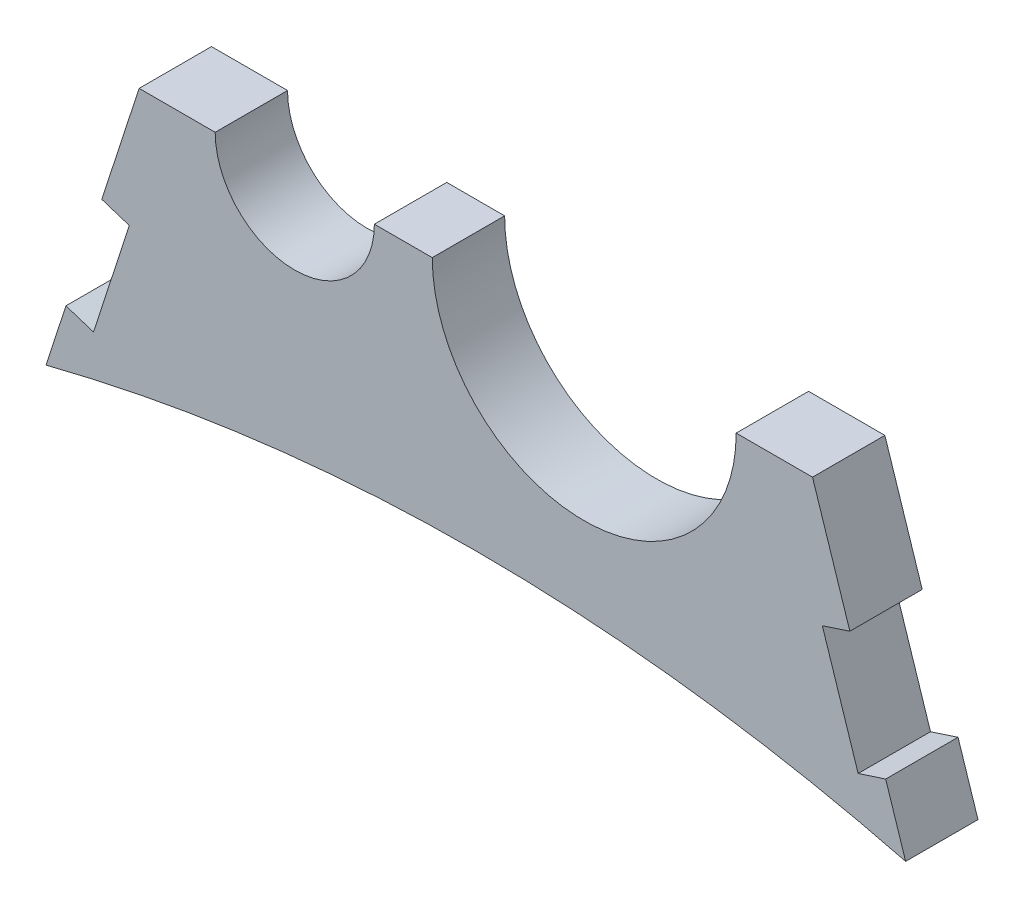
ISO-10303-21;
HEADER;
FILE_DESCRIPTION(('STEP AP214'),'2;1');
FILE_NAME('part.step','',(''),(''),'','','');
FILE_SCHEMA(('AUTOMOTIVE_DESIGN { 1 0 10303 214 1 1 1 1 }'));
ENDSEC;
DATA;
#1=APPLICATION_CONTEXT('core data for automotive mechanical design processes');
#2=APPLICATION_PROTOCOL_DEFINITION('international standard','automotive_design',2000,#1);
#3=PRODUCT_CONTEXT('',#1,'mechanical');
#4=PRODUCT('Part','Part','',(#3));
#5=PRODUCT_RELATED_PRODUCT_CATEGORY('part','',(#4));
#6=PRODUCT_DEFINITION_FORMATION('','',#4);
#7=PRODUCT_DEFINITION_CONTEXT('part definition',#1,'design');
#8=PRODUCT_DEFINITION('design','',#6,#7);
#9=PRODUCT_DEFINITION_SHAPE('','',#8);
#10=(LENGTH_UNIT() NAMED_UNIT(*) SI_UNIT(.MILLI.,.METRE.));
#11=(NAMED_UNIT(*) PLANE_ANGLE_UNIT() SI_UNIT($,.RADIAN.));
#12=(NAMED_UNIT(*) SI_UNIT($,.STERADIAN.) SOLID_ANGLE_UNIT());
#13=UNCERTAINTY_MEASURE_WITH_UNIT(LENGTH_MEASURE(1.E-05),#10,'distance_accuracy_value','');
#14=(GEOMETRIC_REPRESENTATION_CONTEXT(3) GLOBAL_UNCERTAINTY_ASSIGNED_CONTEXT((#13)) GLOBAL_UNIT_ASSIGNED_CONTEXT((#10,
#11,#12)) REPRESENTATION_CONTEXT('',''));
#15=CARTESIAN_POINT('',(0.,0.,0.));
#16=DIRECTION('',(0.,0.,1.));
#17=DIRECTION('',(1.,0.,0.));
#18=AXIS2_PLACEMENT_3D('',#15,#16,#17);
#19=CARTESIAN_POINT('',(9.5123,172.775844824906,6.35));
#20=DIRECTION('',(0.,0.,-1.));
#21=DIRECTION('',(-1.,0.,0.));
#22=AXIS2_PLACEMENT_3D('',#19,#20,#21);
#23=CYLINDRICAL_SURFACE('',#22,13.335);
#24=CARTESIAN_POINT('',(9.5123,172.775844824906,0.));
#25=DIRECTION('',(0.,0.,-1.));
#26=DIRECTION('',(1.,0.,0.));
#27=AXIS2_PLACEMENT_3D('',#24,#25,#26);
#28=CIRCLE('',#27,13.335);
#29=CARTESIAN_POINT('',(22.8473,172.775844824906,0.));
#30=VERTEX_POINT('',#29);
#31=CARTESIAN_POINT('',(-3.82270000000001,172.775844824906,0.));
#32=VERTEX_POINT('',#31);
#33=EDGE_CURVE('E180',#30,#32,#28,.T.);
#34=ORIENTED_EDGE('',*,*,#33,.T.);
#35=DIRECTION('',(0.,0.,-1.));
#36=VECTOR('',#35,1.);
#37=CARTESIAN_POINT('',(-3.82270000000001,172.775844824906,6.35));
#38=LINE('',#37,#36);
#39=CARTESIAN_POINT('',(-3.82270000000001,172.775844824906,6.35));
#40=VERTEX_POINT('',#39);
#41=EDGE_CURVE('E11',#40,#32,#38,.T.);
#42=ORIENTED_EDGE('',*,*,#41,.F.);
#43=CARTESIAN_POINT('',(9.5123,172.775844824906,6.35));
#44=DIRECTION('',(0.,0.,-1.));
#45=DIRECTION('',(1.,0.,0.));
#46=AXIS2_PLACEMENT_3D('',#43,#44,#45);
#47=CIRCLE('',#46,13.335);
#48=CARTESIAN_POINT('',(22.8473,172.775844824906,6.35));
#49=VERTEX_POINT('',#48);
#50=EDGE_CURVE('E210',#49,#40,#47,.T.);
#51=ORIENTED_EDGE('',*,*,#50,.F.);
#52=DIRECTION('',(0.,0.,-1.));
#53=VECTOR('',#52,1.);
#54=CARTESIAN_POINT('',(22.8473,172.775844824906,6.35));
#55=LINE('',#54,#53);
#56=EDGE_CURVE('E176',#49,#30,#55,.T.);
#57=ORIENTED_EDGE('',*,*,#56,.T.);
#58=EDGE_LOOP('',(#34,#42,#51,#57));
#59=FACE_BOUND('',#58,.T.);
#60=ADVANCED_FACE('F36',(#59),#23,.F.);
#61=CARTESIAN_POINT('',(-8.90269999999999,172.775844824906,6.35));
#62=DIRECTION('',(0.,-1.,0.));
#63=DIRECTION('',(0.,0.,-1.));
#64=AXIS2_PLACEMENT_3D('',#61,#62,#63);
#65=PLANE('',#64);
#66=DIRECTION('',(-1.,0.,0.));
#67=VECTOR('',#66,1.);
#68=CARTESIAN_POINT('',(-8.90269999999999,172.775844824906,0.));
#69=LINE('',#68,#67);
#70=CARTESIAN_POINT('',(-8.90269999999999,172.775844824906,0.));
#71=VERTEX_POINT('',#70);
#72=EDGE_CURVE('E183',#32,#71,#69,.T.);
#73=ORIENTED_EDGE('',*,*,#72,.T.);
#74=DIRECTION('',(0.,0.,-1.));
#75=VECTOR('',#74,1.);
#76=CARTESIAN_POINT('',(-8.90269999999999,172.775844824906,6.35));
#77=LINE('',#76,#75);
#78=CARTESIAN_POINT('',(-8.90269999999999,172.775844824906,6.35));
#79=VERTEX_POINT('',#78);
#80=EDGE_CURVE('E44',#79,#71,#77,.T.);
#81=ORIENTED_EDGE('',*,*,#80,.F.);
#82=DIRECTION('',(-1.,0.,0.));
#83=VECTOR('',#82,1.);
#84=CARTESIAN_POINT('',(-8.90269999999999,172.775844824906,6.35));
#85=LINE('',#84,#83);
#86=EDGE_CURVE('E119',#40,#79,#85,.T.);
#87=ORIENTED_EDGE('',*,*,#86,.F.);
#88=ORIENTED_EDGE('',*,*,#41,.T.);
#89=EDGE_LOOP('',(#73,#81,#87,#88));
#90=FACE_BOUND('',#89,.T.);
#91=ADVANCED_FACE('F308',(#90),#65,.F.);
#92=CARTESIAN_POINT('',(-15.8877,172.775844824906,6.35));
#93=DIRECTION('',(0.,0.,-1.));
#94=DIRECTION('',(-1.,0.,0.));
#95=AXIS2_PLACEMENT_3D('',#92,#93,#94);
#96=CYLINDRICAL_SURFACE('',#95,6.985);
#97=CARTESIAN_POINT('',(-15.8877,172.775844824906,0.));
#98=DIRECTION('',(0.,0.,-1.));
#99=DIRECTION('',(1.,0.,0.));
#100=AXIS2_PLACEMENT_3D('',#97,#98,#99);
#101=CIRCLE('',#100,6.985);
#102=CARTESIAN_POINT('',(-22.8727,172.775844824906,0.));
#103=VERTEX_POINT('',#102);
#104=EDGE_CURVE('E185',#71,#103,#101,.T.);
#105=ORIENTED_EDGE('',*,*,#104,.T.);
#106=DIRECTION('',(0.,0.,-1.));
#107=VECTOR('',#106,1.);
#108=CARTESIAN_POINT('',(-22.8727,172.775844824906,6.35));
#109=LINE('',#108,#107);
#110=CARTESIAN_POINT('',(-22.8727,172.775844824906,6.35));
#111=VERTEX_POINT('',#110);
#112=EDGE_CURVE('E241',#111,#103,#109,.T.);
#113=ORIENTED_EDGE('',*,*,#112,.F.);
#114=CARTESIAN_POINT('',(-15.8877,172.775844824906,6.35));
#115=DIRECTION('',(0.,0.,-1.));
#116=DIRECTION('',(1.,0.,0.));
#117=AXIS2_PLACEMENT_3D('',#114,#115,#116);
#118=CIRCLE('',#117,6.985);
#119=EDGE_CURVE('E249',#79,#111,#118,.T.);
#120=ORIENTED_EDGE('',*,*,#119,.F.);
#121=ORIENTED_EDGE('',*,*,#80,.T.);
#122=EDGE_LOOP('',(#105,#113,#120,#121));
#123=FACE_BOUND('',#122,.T.);
#124=ADVANCED_FACE('F247',(#123),#96,.F.);
#125=CARTESIAN_POINT('',(-29.5452417978428,172.775844824906,6.35));
#126=DIRECTION('',(0.,-1.,0.));
#127=DIRECTION('',(0.,0.,-1.));
#128=AXIS2_PLACEMENT_3D('',#125,#126,#127);
#129=PLANE('',#128);
#130=DIRECTION('',(-1.,0.,0.));
#131=VECTOR('',#130,1.);
#132=CARTESIAN_POINT('',(-29.5452417978428,172.775844824906,0.));
#133=LINE('',#132,#131);
#134=CARTESIAN_POINT('',(-29.5452417978428,172.775844824906,0.));
#135=VERTEX_POINT('',#134);
#136=EDGE_CURVE('E187',#103,#135,#133,.T.);
#137=ORIENTED_EDGE('',*,*,#136,.T.);
#138=DIRECTION('',(0.,0.,-1.));
#139=VECTOR('',#138,1.);
#140=CARTESIAN_POINT('',(-29.5452417978428,172.775844824906,6.35));
#141=LINE('',#140,#139);
#142=CARTESIAN_POINT('',(-29.5452417978428,172.775844824906,6.35));
#143=VERTEX_POINT('',#142);
#144=EDGE_CURVE('E238',#143,#135,#141,.T.);
#145=ORIENTED_EDGE('',*,*,#144,.F.);
#146=DIRECTION('',(-1.,0.,0.));
#147=VECTOR('',#146,1.);
#148=CARTESIAN_POINT('',(-29.5452417978428,172.775844824906,6.35));
#149=LINE('',#148,#147);
#150=EDGE_CURVE('E267',#111,#143,#149,.T.);
#151=ORIENTED_EDGE('',*,*,#150,.F.);
#152=ORIENTED_EDGE('',*,*,#112,.T.);
#153=EDGE_LOOP('',(#137,#145,#151,#152));
#154=FACE_BOUND('',#153,.T.);
#155=ADVANCED_FACE('F258',(#154),#129,.F.);
#156=CARTESIAN_POINT('',(-29.5452417978428,172.775844824906,6.35));
#157=DIRECTION('',(0.950933726670704,-0.309394646818859,0.));
#158=DIRECTION('',(0.309394646818859,0.950933726670704,0.));
#159=AXIS2_PLACEMENT_3D('',#156,#157,#158);
#160=PLANE('',#159);
#161=DIRECTION('',(-0.309394646818859,-0.950933726670704,0.));
#162=VECTOR('',#161,1.);
#163=CARTESIAN_POINT('',(-29.5452417978428,172.775844824906,0.));
#164=LINE('',#163,#162);
#165=CARTESIAN_POINT('',(-32.8220378117665,162.704513995176,0.));
#166=VERTEX_POINT('',#165);
#167=EDGE_CURVE('E189',#135,#166,#164,.T.);
#168=ORIENTED_EDGE('',*,*,#167,.T.);
#169=DIRECTION('',(0.,0.,-1.));
#170=VECTOR('',#169,1.);
#171=CARTESIAN_POINT('',(-32.8220378117665,162.704513995176,6.35));
#172=LINE('',#171,#170);
#173=CARTESIAN_POINT('',(-32.8220378117665,162.704513995176,6.35));
#174=VERTEX_POINT('',#173);
#175=EDGE_CURVE('E235',#174,#166,#172,.T.);
#176=ORIENTED_EDGE('',*,*,#175,.F.);
#177=DIRECTION('',(-0.309394646818859,-0.950933726670704,0.));
#178=VECTOR('',#177,1.);
#179=CARTESIAN_POINT('',(-29.5452417978428,172.775844824906,6.35));
#180=LINE('',#179,#178);
#181=EDGE_CURVE('E264',#143,#174,#180,.T.);
#182=ORIENTED_EDGE('',*,*,#181,.F.);
#183=ORIENTED_EDGE('',*,*,#144,.T.);
#184=EDGE_LOOP('',(#168,#176,#182,#183));
#185=FACE_BOUND('',#184,.T.);
#186=ADVANCED_FACE('F262',(#185),#160,.F.);
#187=CARTESIAN_POINT('',(-32.8220378117665,162.704513995176,6.35));
#188=DIRECTION('',(0.309394646818844,0.950933726670709,0.));
#189=DIRECTION('',(-0.950933726670709,0.309394646818844,0.));
#190=AXIS2_PLACEMENT_3D('',#187,#188,#189);
#191=PLANE('',#190);
#192=DIRECTION('',(0.950933726670709,-0.309394646818844,0.));
#193=VECTOR('',#192,1.);
#194=CARTESIAN_POINT('',(-32.8220378117665,162.704513995176,0.));
#195=LINE('',#194,#193);
#196=CARTESIAN_POINT('',(-30.4066661460229,161.918651592256,0.));
#197=VERTEX_POINT('',#196);
#198=EDGE_CURVE('E191',#166,#197,#195,.T.);
#199=ORIENTED_EDGE('',*,*,#198,.T.);
#200=DIRECTION('',(0.,0.,-1.));
#201=VECTOR('',#200,1.);
#202=CARTESIAN_POINT('',(-30.4066661460229,161.918651592256,6.35));
#203=LINE('',#202,#201);
#204=CARTESIAN_POINT('',(-30.4066661460229,161.918651592256,6.35));
#205=VERTEX_POINT('',#204);
#206=EDGE_CURVE('E232',#205,#197,#203,.T.);
#207=ORIENTED_EDGE('',*,*,#206,.F.);
#208=DIRECTION('',(0.950933726670709,-0.309394646818844,0.));
#209=VECTOR('',#208,1.);
#210=CARTESIAN_POINT('',(-32.8220378117665,162.704513995176,6.35));
#211=LINE('',#210,#209);
#212=EDGE_CURVE('E266',#174,#205,#211,.T.);
#213=ORIENTED_EDGE('',*,*,#212,.F.);
#214=ORIENTED_EDGE('',*,*,#175,.T.);
#215=EDGE_LOOP('',(#199,#207,#213,#214));
#216=FACE_BOUND('',#215,.T.);
#217=ADVANCED_FACE('F321',(#216),#191,.F.);
#218=CARTESIAN_POINT('',(-30.4066661460229,161.918651592256,6.35));
#219=DIRECTION('',(0.950933726670734,-0.309394646818767,0.));
#220=DIRECTION('',(0.309394646818767,0.950933726670734,0.));
#221=AXIS2_PLACEMENT_3D('',#218,#219,#220);
#222=PLANE('',#221);
#223=DIRECTION('',(-0.309394646818767,-0.950933726670734,0.));
#224=VECTOR('',#223,1.);
#225=CARTESIAN_POINT('',(-30.4066661460229,161.918651592256,0.));
#226=LINE('',#225,#224);
#227=CARTESIAN_POINT('',(-33.5501157577015,152.257164929282,0.));
#228=VERTEX_POINT('',#227);
#229=EDGE_CURVE('E193',#197,#228,#226,.T.);
#230=ORIENTED_EDGE('',*,*,#229,.T.);
#231=DIRECTION('',(0.,0.,-1.));
#232=VECTOR('',#231,1.);
#233=CARTESIAN_POINT('',(-33.5501157577015,152.257164929282,6.35));
#234=LINE('',#233,#232);
#235=CARTESIAN_POINT('',(-33.5501157577015,152.257164929282,6.35));
#236=VERTEX_POINT('',#235);
#237=EDGE_CURVE('E229',#236,#228,#234,.T.);
#238=ORIENTED_EDGE('',*,*,#237,.F.);
#239=DIRECTION('',(-0.309394646818767,-0.950933726670734,0.));
#240=VECTOR('',#239,1.);
#241=CARTESIAN_POINT('',(-30.4066661460229,161.918651592256,6.35));
#242=LINE('',#241,#240);
#243=EDGE_CURVE('E269',#205,#236,#242,.T.);
#244=ORIENTED_EDGE('',*,*,#243,.F.);
#245=ORIENTED_EDGE('',*,*,#206,.T.);
#246=EDGE_LOOP('',(#230,#238,#244,#245));
#247=FACE_BOUND('',#246,.T.);
#248=ADVANCED_FACE('F324',(#247),#222,.F.);
#249=CARTESIAN_POINT('',(-33.5501157577015,152.257164929282,6.35));
#250=DIRECTION('',(-0.309394646818855,-0.950933726670706,0.));
#251=DIRECTION('',(0.950933726670706,-0.309394646818855,0.));
#252=AXIS2_PLACEMENT_3D('',#249,#250,#251);
#253=PLANE('',#252);
#254=DIRECTION('',(-0.950933726670706,0.309394646818855,0.));
#255=VECTOR('',#254,1.);
#256=CARTESIAN_POINT('',(-33.5501157577015,152.257164929282,0.));
#257=LINE('',#256,#255);
#258=CARTESIAN_POINT('',(-35.9654874234461,153.043027332202,0.));
#259=VERTEX_POINT('',#258);
#260=EDGE_CURVE('E195',#228,#259,#257,.T.);
#261=ORIENTED_EDGE('',*,*,#260,.T.);
#262=DIRECTION('',(0.,0.,-1.));
#263=VECTOR('',#262,1.);
#264=CARTESIAN_POINT('',(-35.9654874234461,153.043027332202,6.35));
#265=LINE('',#264,#263);
#266=CARTESIAN_POINT('',(-35.9654874234461,153.043027332202,6.35));
#267=VERTEX_POINT('',#266);
#268=EDGE_CURVE('E226',#267,#259,#265,.T.);
#269=ORIENTED_EDGE('',*,*,#268,.F.);
#270=DIRECTION('',(-0.950933726670706,0.309394646818855,0.));
#271=VECTOR('',#270,1.);
#272=CARTESIAN_POINT('',(-33.5501157577015,152.257164929282,6.35));
#273=LINE('',#272,#271);
#274=EDGE_CURVE('E275',#236,#267,#273,.T.);
#275=ORIENTED_EDGE('',*,*,#274,.F.);
#276=ORIENTED_EDGE('',*,*,#237,.T.);
#277=EDGE_LOOP('',(#261,#269,#275,#276));
#278=FACE_BOUND('',#277,.T.);
#279=ADVANCED_FACE('F328',(#278),#253,.F.);
#280=CARTESIAN_POINT('',(-37.7172395441766,147.658964648839,6.35));
#281=DIRECTION('',(0.950933726670701,-0.309394646818868,0.));
#282=DIRECTION('',(0.309394646818868,0.950933726670701,0.));
#283=AXIS2_PLACEMENT_3D('',#280,#281,#282);
#284=PLANE('',#283);
#285=DIRECTION('',(-0.309394646818868,-0.950933726670701,0.));
#286=VECTOR('',#285,1.);
#287=CARTESIAN_POINT('',(-37.7172395441766,147.658964648839,0.));
#288=LINE('',#287,#286);
#289=CARTESIAN_POINT('',(-37.7172395441766,147.658964648839,0.));
#290=VERTEX_POINT('',#289);
#291=EDGE_CURVE('E197',#259,#290,#288,.T.);
#292=ORIENTED_EDGE('',*,*,#291,.T.);
#293=DIRECTION('',(0.,0.,-1.));
#294=VECTOR('',#293,1.);
#295=CARTESIAN_POINT('',(-37.7172395441766,147.658964648839,6.35));
#296=LINE('',#295,#294);
#297=CARTESIAN_POINT('',(-37.7172395441766,147.658964648839,6.35));
#298=VERTEX_POINT('',#297);
#299=EDGE_CURVE('E223',#298,#290,#296,.T.);
#300=ORIENTED_EDGE('',*,*,#299,.F.);
#301=DIRECTION('',(-0.309394646818868,-0.950933726670701,0.));
#302=VECTOR('',#301,1.);
#303=CARTESIAN_POINT('',(-37.7172395441766,147.658964648839,6.35));
#304=LINE('',#303,#302);
#305=EDGE_CURVE('E277',#267,#298,#304,.T.);
#306=ORIENTED_EDGE('',*,*,#305,.F.);
#307=ORIENTED_EDGE('',*,*,#268,.T.);
#308=EDGE_LOOP('',(#292,#300,#306,#307));
#309=FACE_BOUND('',#308,.T.);
#310=ADVANCED_FACE('F332',(#309),#284,.F.);
#311=CARTESIAN_POINT('',(0.,0.,6.35));
#312=DIRECTION('',(0.,0.,-1.));
#313=DIRECTION('',(-1.,0.,0.));
#314=AXIS2_PLACEMENT_3D('',#311,#312,#313);
#315=CYLINDRICAL_SURFACE('',#314,152.4);
#316=CARTESIAN_POINT('',(0.,0.,0.));
#317=DIRECTION('',(0.,0.,-1.));
#318=DIRECTION('',(1.,0.,0.));
#319=AXIS2_PLACEMENT_3D('',#316,#317,#318);
#320=CIRCLE('',#319,152.4);
#321=CARTESIAN_POINT('',(37.7172395441766,147.658964648839,0.));
#322=VERTEX_POINT('',#321);
#323=EDGE_CURVE('E199',#290,#322,#320,.T.);
#324=ORIENTED_EDGE('',*,*,#323,.T.);
#325=DIRECTION('',(0.,0.,-1.));
#326=VECTOR('',#325,1.);
#327=CARTESIAN_POINT('',(37.7172395441766,147.658964648839,6.35));
#328=LINE('',#327,#326);
#329=CARTESIAN_POINT('',(37.7172395441766,147.658964648839,6.35));
#330=VERTEX_POINT('',#329);
#331=EDGE_CURVE('E220',#330,#322,#328,.T.);
#332=ORIENTED_EDGE('',*,*,#331,.F.);
#333=CARTESIAN_POINT('',(0.,0.,6.35));
#334=DIRECTION('',(0.,0.,-1.));
#335=DIRECTION('',(1.,0.,0.));
#336=AXIS2_PLACEMENT_3D('',#333,#334,#335);
#337=CIRCLE('',#336,152.4);
#338=EDGE_CURVE('E279',#298,#330,#337,.T.);
#339=ORIENTED_EDGE('',*,*,#338,.F.);
#340=ORIENTED_EDGE('',*,*,#299,.T.);
#341=EDGE_LOOP('',(#324,#332,#339,#340));
#342=FACE_BOUND('',#341,.T.);
#343=ADVANCED_FACE('F336',(#342),#315,.F.);
#344=CARTESIAN_POINT('',(37.7172395441766,147.658964648839,6.35));
#345=DIRECTION('',(-0.950933726670705,-0.309394646818857,0.));
#346=DIRECTION('',(0.309394646818857,-0.950933726670705,0.));
#347=AXIS2_PLACEMENT_3D('',#344,#345,#346);
#348=PLANE('',#347);
#349=DIRECTION('',(-0.309394646818857,0.950933726670705,0.));
#350=VECTOR('',#349,1.);
#351=CARTESIAN_POINT('',(37.7172395441766,147.658964648839,0.));
#352=LINE('',#351,#350);
#353=CARTESIAN_POINT('',(35.9654874234463,153.043027332201,0.));
#354=VERTEX_POINT('',#353);
#355=EDGE_CURVE('E201',#322,#354,#352,.T.);
#356=ORIENTED_EDGE('',*,*,#355,.T.);
#357=DIRECTION('',(0.,0.,-1.));
#358=VECTOR('',#357,1.);
#359=CARTESIAN_POINT('',(35.9654874234463,153.043027332201,6.35));
#360=LINE('',#359,#358);
#361=CARTESIAN_POINT('',(35.9654874234463,153.043027332201,6.35));
#362=VERTEX_POINT('',#361);
#363=EDGE_CURVE('E217',#362,#354,#360,.T.);
#364=ORIENTED_EDGE('',*,*,#363,.F.);
#365=DIRECTION('',(-0.309394646818857,0.950933726670705,0.));
#366=VECTOR('',#365,1.);
#367=CARTESIAN_POINT('',(37.7172395441766,147.658964648839,6.35));
#368=LINE('',#367,#366);
#369=EDGE_CURVE('E281',#330,#362,#368,.T.);
#370=ORIENTED_EDGE('',*,*,#369,.F.);
#371=ORIENTED_EDGE('',*,*,#331,.T.);
#372=EDGE_LOOP('',(#356,#364,#370,#371));
#373=FACE_BOUND('',#372,.T.);
#374=ADVANCED_FACE('F340',(#373),#348,.F.);
#375=CARTESIAN_POINT('',(33.5501157577026,152.257164929281,6.35));
#376=DIRECTION('',(0.309394646818867,-0.950933726670701,0.));
#377=DIRECTION('',(0.950933726670702,0.309394646818867,0.));
#378=AXIS2_PLACEMENT_3D('',#375,#376,#377);
#379=PLANE('',#378);
#380=DIRECTION('',(-0.950933726670701,-0.309394646818867,0.));
#381=VECTOR('',#380,1.);
#382=CARTESIAN_POINT('',(33.5501157577026,152.257164929281,0.));
#383=LINE('',#382,#381);
#384=CARTESIAN_POINT('',(33.5501157577026,152.257164929281,0.));
#385=VERTEX_POINT('',#384);
#386=EDGE_CURVE('E203',#354,#385,#383,.T.);
#387=ORIENTED_EDGE('',*,*,#386,.T.);
#388=DIRECTION('',(0.,0.,-1.));
#389=VECTOR('',#388,1.);
#390=CARTESIAN_POINT('',(33.5501157577026,152.257164929281,6.35));
#391=LINE('',#390,#389);
#392=CARTESIAN_POINT('',(33.5501157577026,152.257164929281,6.35));
#393=VERTEX_POINT('',#392);
#394=EDGE_CURVE('E214',#393,#385,#391,.T.);
#395=ORIENTED_EDGE('',*,*,#394,.F.);
#396=DIRECTION('',(-0.950933726670701,-0.309394646818867,0.));
#397=VECTOR('',#396,1.);
#398=CARTESIAN_POINT('',(33.5501157577026,152.257164929281,6.35));
#399=LINE('',#398,#397);
#400=EDGE_CURVE('E283',#362,#393,#399,.T.);
#401=ORIENTED_EDGE('',*,*,#400,.F.);
#402=ORIENTED_EDGE('',*,*,#363,.T.);
#403=EDGE_LOOP('',(#387,#395,#401,#402));
#404=FACE_BOUND('',#403,.T.);
#405=ADVANCED_FACE('F289',(#404),#379,.F.);
#406=CARTESIAN_POINT('',(30.406666146023,161.918651592256,6.35));
#407=DIRECTION('',(-0.950933726670704,-0.309394646818858,0.));
#408=DIRECTION('',(0.309394646818858,-0.950933726670704,0.));
#409=AXIS2_PLACEMENT_3D('',#406,#407,#408);
#410=PLANE('',#409);
#411=DIRECTION('',(-0.309394646818858,0.950933726670704,0.));
#412=VECTOR('',#411,1.);
#413=CARTESIAN_POINT('',(30.406666146023,161.918651592256,0.));
#414=LINE('',#413,#412);
#415=CARTESIAN_POINT('',(30.406666146023,161.918651592256,0.));
#416=VERTEX_POINT('',#415);
#417=EDGE_CURVE('E205',#385,#416,#414,.T.);
#418=ORIENTED_EDGE('',*,*,#417,.T.);
#419=DIRECTION('',(0.,0.,-1.));
#420=VECTOR('',#419,1.);
#421=CARTESIAN_POINT('',(30.406666146023,161.918651592256,6.35));
#422=LINE('',#421,#420);
#423=CARTESIAN_POINT('',(30.406666146023,161.918651592256,6.35));
#424=VERTEX_POINT('',#423);
#425=EDGE_CURVE('E171',#424,#416,#422,.T.);
#426=ORIENTED_EDGE('',*,*,#425,.F.);
#427=DIRECTION('',(-0.309394646818858,0.950933726670704,0.));
#428=VECTOR('',#427,1.);
#429=CARTESIAN_POINT('',(30.406666146023,161.918651592256,6.35));
#430=LINE('',#429,#428);
#431=EDGE_CURVE('E162',#393,#424,#430,.T.);
#432=ORIENTED_EDGE('',*,*,#431,.F.);
#433=ORIENTED_EDGE('',*,*,#394,.T.);
#434=EDGE_LOOP('',(#418,#426,#432,#433));
#435=FACE_BOUND('',#434,.T.);
#436=ADVANCED_FACE('F293',(#435),#410,.F.);
#437=CARTESIAN_POINT('',(32.8220378117667,162.704513995176,6.35));
#438=DIRECTION('',(-0.30939464681887,0.950933726670701,0.));
#439=DIRECTION('',(-0.950933726670701,-0.30939464681887,0.));
#440=AXIS2_PLACEMENT_3D('',#437,#438,#439);
#441=PLANE('',#440);
#442=DIRECTION('',(0.950933726670701,0.30939464681887,0.));
#443=VECTOR('',#442,1.);
#444=CARTESIAN_POINT('',(32.8220378117667,162.704513995176,0.));
#445=LINE('',#444,#443);
#446=CARTESIAN_POINT('',(32.8220378117667,162.704513995176,0.));
#447=VERTEX_POINT('',#446);
#448=EDGE_CURVE('E170',#416,#447,#445,.T.);
#449=ORIENTED_EDGE('',*,*,#448,.T.);
#450=DIRECTION('',(0.,0.,-1.));
#451=VECTOR('',#450,1.);
#452=CARTESIAN_POINT('',(32.8220378117667,162.704513995176,6.35));
#453=LINE('',#452,#451);
#454=CARTESIAN_POINT('',(32.8220378117667,162.704513995176,6.35));
#455=VERTEX_POINT('',#454);
#456=EDGE_CURVE('E167',#455,#447,#453,.T.);
#457=ORIENTED_EDGE('',*,*,#456,.F.);
#458=DIRECTION('',(0.950933726670701,0.30939464681887,0.));
#459=VECTOR('',#458,1.);
#460=CARTESIAN_POINT('',(32.8220378117667,162.704513995176,6.35));
#461=LINE('',#460,#459);
#462=EDGE_CURVE('E156',#424,#455,#461,.T.);
#463=ORIENTED_EDGE('',*,*,#462,.F.);
#464=ORIENTED_EDGE('',*,*,#425,.T.);
#465=EDGE_LOOP('',(#449,#457,#463,#464));
#466=FACE_BOUND('',#465,.T.);
#467=ADVANCED_FACE('F168',(#466),#441,.F.);
#468=CARTESIAN_POINT('',(29.5452417978428,172.775844824906,6.35));
#469=DIRECTION('',(-0.950933726670703,-0.309394646818863,0.));
#470=DIRECTION('',(0.309394646818863,-0.950933726670703,0.));
#471=AXIS2_PLACEMENT_3D('',#468,#469,#470);
#472=PLANE('',#471);
#473=DIRECTION('',(-0.309394646818863,0.950933726670703,0.));
#474=VECTOR('',#473,1.);
#475=CARTESIAN_POINT('',(29.5452417978428,172.775844824906,0.));
#476=LINE('',#475,#474);
#477=CARTESIAN_POINT('',(29.5452417978428,172.775844824906,0.));
#478=VERTEX_POINT('',#477);
#479=EDGE_CURVE('E105',#447,#478,#476,.T.);
#480=ORIENTED_EDGE('',*,*,#479,.T.);
#481=DIRECTION('',(0.,0.,-1.));
#482=VECTOR('',#481,1.);
#483=CARTESIAN_POINT('',(29.5452417978428,172.775844824906,6.35));
#484=LINE('',#483,#482);
#485=CARTESIAN_POINT('',(29.5452417978428,172.775844824906,6.35));
#486=VERTEX_POINT('',#485);
#487=EDGE_CURVE('E172',#486,#478,#484,.T.);
#488=ORIENTED_EDGE('',*,*,#487,.F.);
#489=DIRECTION('',(-0.309394646818863,0.950933726670703,0.));
#490=VECTOR('',#489,1.);
#491=CARTESIAN_POINT('',(29.5452417978428,172.775844824906,6.35));
#492=LINE('',#491,#490);
#493=EDGE_CURVE('E160',#455,#486,#492,.T.);
#494=ORIENTED_EDGE('',*,*,#493,.F.);
#495=ORIENTED_EDGE('',*,*,#456,.T.);
#496=EDGE_LOOP('',(#480,#488,#494,#495));
#497=FACE_BOUND('',#496,.T.);
#498=ADVANCED_FACE('F174',(#497),#472,.F.);
#499=CARTESIAN_POINT('',(22.8473,172.775844824906,6.35));
#500=DIRECTION('',(0.,-1.,0.));
#501=DIRECTION('',(0.,0.,-1.));
#502=AXIS2_PLACEMENT_3D('',#499,#500,#501);
#503=PLANE('',#502);
#504=DIRECTION('',(-1.,0.,0.));
#505=VECTOR('',#504,1.);
#506=CARTESIAN_POINT('',(22.8473,172.775844824906,0.));
#507=LINE('',#506,#505);
#508=EDGE_CURVE('E111',#478,#30,#507,.T.);
#509=ORIENTED_EDGE('',*,*,#508,.T.);
#510=ORIENTED_EDGE('',*,*,#56,.F.);
#511=DIRECTION('',(-1.,0.,0.));
#512=VECTOR('',#511,1.);
#513=CARTESIAN_POINT('',(22.8473,172.775844824906,6.35));
#514=LINE('',#513,#512);
#515=EDGE_CURVE('E52',#486,#49,#514,.T.);
#516=ORIENTED_EDGE('',*,*,#515,.F.);
#517=ORIENTED_EDGE('',*,*,#487,.T.);
#518=EDGE_LOOP('',(#509,#510,#516,#517));
#519=FACE_BOUND('',#518,.T.);
#520=ADVANCED_FACE('F297',(#519),#503,.F.);
#521=CARTESIAN_POINT('',(9.5123,172.775844824906,6.35));
#522=DIRECTION('',(0.,0.,1.));
#523=DIRECTION('',(1.,0.,0.));
#524=AXIS2_PLACEMENT_3D('',#521,#522,#523);
#525=PLANE('',#524);
#526=ORIENTED_EDGE('',*,*,#50,.T.);
#527=ORIENTED_EDGE('',*,*,#86,.T.);
#528=ORIENTED_EDGE('',*,*,#119,.T.);
#529=ORIENTED_EDGE('',*,*,#150,.T.);
#530=ORIENTED_EDGE('',*,*,#181,.T.);
#531=ORIENTED_EDGE('',*,*,#212,.T.);
#532=ORIENTED_EDGE('',*,*,#243,.T.);
#533=ORIENTED_EDGE('',*,*,#274,.T.);
#534=ORIENTED_EDGE('',*,*,#305,.T.);
#535=ORIENTED_EDGE('',*,*,#338,.T.);
#536=ORIENTED_EDGE('',*,*,#369,.T.);
#537=ORIENTED_EDGE('',*,*,#400,.T.);
#538=ORIENTED_EDGE('',*,*,#431,.T.);
#539=ORIENTED_EDGE('',*,*,#462,.T.);
#540=ORIENTED_EDGE('',*,*,#493,.T.);
#541=ORIENTED_EDGE('',*,*,#515,.T.);
#542=EDGE_LOOP('',(#526,#527,#528,#529,#530,#531,#532,#533,#534,#535,#536,#537,#538,#539,#540,#541));
#543=FACE_BOUND('',#542,.T.);
#544=ADVANCED_FACE('F158',(#543),#525,.T.);
#545=CARTESIAN_POINT('',(9.5123,172.775844824906,0.));
#546=DIRECTION('',(0.,0.,1.));
#547=DIRECTION('',(1.,0.,0.));
#548=AXIS2_PLACEMENT_3D('',#545,#546,#547);
#549=PLANE('',#548);
#550=ORIENTED_EDGE('',*,*,#33,.F.);
#551=ORIENTED_EDGE('',*,*,#508,.F.);
#552=ORIENTED_EDGE('',*,*,#479,.F.);
#553=ORIENTED_EDGE('',*,*,#448,.F.);
#554=ORIENTED_EDGE('',*,*,#417,.F.);
#555=ORIENTED_EDGE('',*,*,#386,.F.);
#556=ORIENTED_EDGE('',*,*,#355,.F.);
#557=ORIENTED_EDGE('',*,*,#323,.F.);
#558=ORIENTED_EDGE('',*,*,#291,.F.);
#559=ORIENTED_EDGE('',*,*,#260,.F.);
#560=ORIENTED_EDGE('',*,*,#229,.F.);
#561=ORIENTED_EDGE('',*,*,#198,.F.);
#562=ORIENTED_EDGE('',*,*,#167,.F.);
#563=ORIENTED_EDGE('',*,*,#136,.F.);
#564=ORIENTED_EDGE('',*,*,#104,.F.);
#565=ORIENTED_EDGE('',*,*,#72,.F.);
#566=EDGE_LOOP('',(#550,#551,#552,#553,#554,#555,#556,#557,#558,#559,#560,#561,#562,#563,#564,#565));
#567=FACE_BOUND('',#566,.T.);
#568=ADVANCED_FACE('F253',(#567),#549,.F.);
#569=CLOSED_SHELL('',(#60,#91,#124,#155,#186,#217,#248,#279,#310,#343,#374,#405,#436,#467,#498,
#520,#544,#568));
#570=MANIFOLD_SOLID_BREP('B2',#569);
#571=ADVANCED_BREP_SHAPE_REPRESENTATION('',(#18,#570),#14);
#572=SHAPE_DEFINITION_REPRESENTATION(#9,#571);
ENDSEC;
END-ISO-10303-21;
